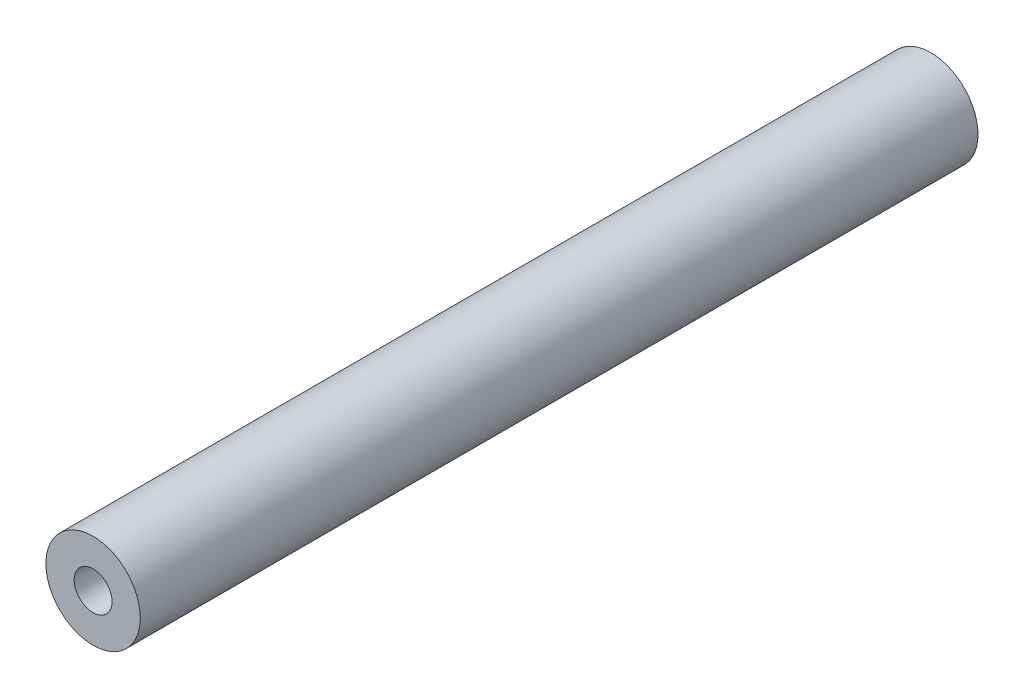
ISO-10303-21;
HEADER;
FILE_DESCRIPTION(('STEP AP214'),'2;1');
FILE_NAME('part.step','',(''),(''),'','','');
FILE_SCHEMA(('AUTOMOTIVE_DESIGN { 1 0 10303 214 1 1 1 1 }'));
ENDSEC;
DATA;
#1=APPLICATION_CONTEXT('core data for automotive mechanical design processes');
#2=APPLICATION_PROTOCOL_DEFINITION('international standard','automotive_design',2000,#1);
#3=PRODUCT_CONTEXT('',#1,'mechanical');
#4=PRODUCT('Part','Part','',(#3));
#5=PRODUCT_RELATED_PRODUCT_CATEGORY('part','',(#4));
#6=PRODUCT_DEFINITION_FORMATION('','',#4);
#7=PRODUCT_DEFINITION_CONTEXT('part definition',#1,'design');
#8=PRODUCT_DEFINITION('design','',#6,#7);
#9=PRODUCT_DEFINITION_SHAPE('','',#8);
#10=(LENGTH_UNIT() NAMED_UNIT(*) SI_UNIT(.MILLI.,.METRE.));
#11=(NAMED_UNIT(*) PLANE_ANGLE_UNIT() SI_UNIT($,.RADIAN.));
#12=(NAMED_UNIT(*) SI_UNIT($,.STERADIAN.) SOLID_ANGLE_UNIT());
#13=UNCERTAINTY_MEASURE_WITH_UNIT(LENGTH_MEASURE(1.E-05),#10,'distance_accuracy_value','');
#14=(GEOMETRIC_REPRESENTATION_CONTEXT(3) GLOBAL_UNCERTAINTY_ASSIGNED_CONTEXT((#13)) GLOBAL_UNIT_ASSIGNED_CONTEXT((#10,
#11,#12)) REPRESENTATION_CONTEXT('',''));
#15=CARTESIAN_POINT('',(0.,0.,0.));
#16=DIRECTION('',(0.,0.,1.));
#17=DIRECTION('',(1.,0.,0.));
#18=AXIS2_PLACEMENT_3D('',#15,#16,#17);
#19=CARTESIAN_POINT('',(0.,0.,56.35625));
#20=DIRECTION('',(0.,0.,-1.));
#21=DIRECTION('',(-1.,0.,0.));
#22=AXIS2_PLACEMENT_3D('',#19,#20,#21);
#23=CYLINDRICAL_SURFACE('',#22,6.35);
#24=CARTESIAN_POINT('',(0.,0.,56.35625));
#25=DIRECTION('',(0.,0.,1.));
#26=DIRECTION('',(1.,0.,0.));
#27=AXIS2_PLACEMENT_3D('',#24,#25,#26);
#28=CIRCLE('',#27,6.35);
#29=CARTESIAN_POINT('',(6.35,0.,56.35625));
#30=VERTEX_POINT('',#29);
#31=EDGE_CURVE('E11',#30,#30,#28,.T.);
#32=ORIENTED_EDGE('',*,*,#31,.F.);
#33=EDGE_LOOP('',(#32));
#34=FACE_BOUND('',#33,.T.);
#35=CARTESIAN_POINT('',(0.,0.,-56.35625));
#36=DIRECTION('',(0.,0.,1.));
#37=DIRECTION('',(1.,0.,0.));
#38=AXIS2_PLACEMENT_3D('',#35,#36,#37);
#39=CIRCLE('',#38,6.35);
#40=CARTESIAN_POINT('',(6.35,0.,-56.35625));
#41=VERTEX_POINT('',#40);
#42=EDGE_CURVE('E41',#41,#41,#39,.T.);
#43=ORIENTED_EDGE('',*,*,#42,.T.);
#44=EDGE_LOOP('',(#43));
#45=FACE_BOUND('',#44,.T.);
#46=ADVANCED_FACE('F38',(#34,#45),#23,.T.);
#47=CARTESIAN_POINT('',(0.,0.,56.35625));
#48=DIRECTION('',(0.,0.,1.));
#49=DIRECTION('',(1.,0.,0.));
#50=AXIS2_PLACEMENT_3D('',#47,#48,#49);
#51=PLANE('',#50);
#52=CARTESIAN_POINT('',(0.,0.,56.35625));
#53=DIRECTION('',(0.,0.,1.));
#54=DIRECTION('',(1.,0.,0.));
#55=AXIS2_PLACEMENT_3D('',#52,#53,#54);
#56=CIRCLE('',#55,2.55269999999999);
#57=CARTESIAN_POINT('',(2.55269999999999,0.,56.35625));
#58=VERTEX_POINT('',#57);
#59=EDGE_CURVE('E61',#58,#58,#56,.T.);
#60=ORIENTED_EDGE('',*,*,#59,.F.);
#61=EDGE_LOOP('',(#60));
#62=FACE_BOUND('',#61,.T.);
#63=ORIENTED_EDGE('',*,*,#31,.T.);
#64=EDGE_LOOP('',(#63));
#65=FACE_BOUND('',#64,.T.);
#66=ADVANCED_FACE('F80',(#62,#65),#51,.T.);
#67=CARTESIAN_POINT('',(0.,0.,-56.35625));
#68=DIRECTION('',(0.,0.,1.));
#69=DIRECTION('',(1.,0.,0.));
#70=AXIS2_PLACEMENT_3D('',#67,#68,#69);
#71=PLANE('',#70);
#72=CARTESIAN_POINT('',(0.,0.,-56.35625));
#73=DIRECTION('',(0.,0.,-1.));
#74=DIRECTION('',(-1.,0.,0.));
#75=AXIS2_PLACEMENT_3D('',#72,#73,#74);
#76=CIRCLE('',#75,2.55269999999999);
#77=CARTESIAN_POINT('',(-2.55269999999999,0.,-56.35625));
#78=VERTEX_POINT('',#77);
#79=EDGE_CURVE('E62',#78,#78,#76,.T.);
#80=ORIENTED_EDGE('',*,*,#79,.F.);
#81=EDGE_LOOP('',(#80));
#82=FACE_BOUND('',#81,.T.);
#83=ORIENTED_EDGE('',*,*,#42,.F.);
#84=EDGE_LOOP('',(#83));
#85=FACE_BOUND('',#84,.T.);
#86=ADVANCED_FACE('F77',(#82,#85),#71,.F.);
#87=CARTESIAN_POINT('',(0.,0.,37.30625));
#88=DIRECTION('',(0.,0.,1.));
#89=DIRECTION('',(1.,0.,0.));
#90=AXIS2_PLACEMENT_3D('',#87,#88,#89);
#91=CONICAL_SURFACE('',#90,2.55269999999999,1.02974425867665);
#92=CARTESIAN_POINT('',(0.,0.,35.7724330978083));
#93=VERTEX_POINT('',#92);
#94=VERTEX_LOOP('',#93);
#95=FACE_BOUND('',#94,.T.);
#96=CARTESIAN_POINT('',(0.,0.,37.30625));
#97=DIRECTION('',(0.,0.,1.));
#98=DIRECTION('',(1.,0.,0.));
#99=AXIS2_PLACEMENT_3D('',#96,#97,#98);
#100=CIRCLE('',#99,2.55269999999999);
#101=CARTESIAN_POINT('',(2.55269999999999,0.,37.30625));
#102=VERTEX_POINT('',#101);
#103=EDGE_CURVE('E65',#102,#102,#100,.T.);
#104=ORIENTED_EDGE('',*,*,#103,.T.);
#105=EDGE_LOOP('',(#104));
#106=FACE_BOUND('',#105,.T.);
#107=ADVANCED_FACE('F79',(#95,#106),#91,.F.);
#108=CARTESIAN_POINT('',(0.,0.,56.35625));
#109=DIRECTION('',(0.,0.,1.));
#110=DIRECTION('',(1.,0.,0.));
#111=AXIS2_PLACEMENT_3D('',#108,#109,#110);
#112=CYLINDRICAL_SURFACE('',#111,2.55269999999999);
#113=ORIENTED_EDGE('',*,*,#103,.F.);
#114=EDGE_LOOP('',(#113));
#115=FACE_BOUND('',#114,.T.);
#116=ORIENTED_EDGE('',*,*,#59,.T.);
#117=EDGE_LOOP('',(#116));
#118=FACE_BOUND('',#117,.T.);
#119=ADVANCED_FACE('F55',(#115,#118),#112,.F.);
#120=CARTESIAN_POINT('',(0.,0.,-37.30625));
#121=DIRECTION('',(0.,0.,-1.));
#122=DIRECTION('',(-1.,0.,0.));
#123=AXIS2_PLACEMENT_3D('',#120,#121,#122);
#124=CONICAL_SURFACE('',#123,2.55269999999999,1.02974425867665);
#125=CARTESIAN_POINT('',(0.,0.,-35.7724330978083));
#126=VERTEX_POINT('',#125);
#127=VERTEX_LOOP('',#126);
#128=FACE_BOUND('',#127,.T.);
#129=CARTESIAN_POINT('',(0.,0.,-37.30625));
#130=DIRECTION('',(0.,0.,-1.));
#131=DIRECTION('',(-1.,0.,0.));
#132=AXIS2_PLACEMENT_3D('',#129,#130,#131);
#133=CIRCLE('',#132,2.55269999999999);
#134=CARTESIAN_POINT('',(-2.55269999999999,0.,-37.30625));
#135=VERTEX_POINT('',#134);
#136=EDGE_CURVE('E59',#135,#135,#133,.T.);
#137=ORIENTED_EDGE('',*,*,#136,.T.);
#138=EDGE_LOOP('',(#137));
#139=FACE_BOUND('',#138,.T.);
#140=ADVANCED_FACE('F51',(#128,#139),#124,.F.);
#141=CARTESIAN_POINT('',(0.,0.,-56.35625));
#142=DIRECTION('',(0.,0.,-1.));
#143=DIRECTION('',(-1.,0.,0.));
#144=AXIS2_PLACEMENT_3D('',#141,#142,#143);
#145=CYLINDRICAL_SURFACE('',#144,2.55269999999999);
#146=ORIENTED_EDGE('',*,*,#136,.F.);
#147=EDGE_LOOP('',(#146));
#148=FACE_BOUND('',#147,.T.);
#149=ORIENTED_EDGE('',*,*,#79,.T.);
#150=EDGE_LOOP('',(#149));
#151=FACE_BOUND('',#150,.T.);
#152=ADVANCED_FACE('F54',(#148,#151),#145,.F.);
#153=CLOSED_SHELL('',(#46,#66,#86,#107,#119,#140,#152));
#154=MANIFOLD_SOLID_BREP('B2',#153);
#155=ADVANCED_BREP_SHAPE_REPRESENTATION('',(#18,#154),#14);
#156=SHAPE_DEFINITION_REPRESENTATION(#9,#155);
ENDSEC;
END-ISO-10303-21;
